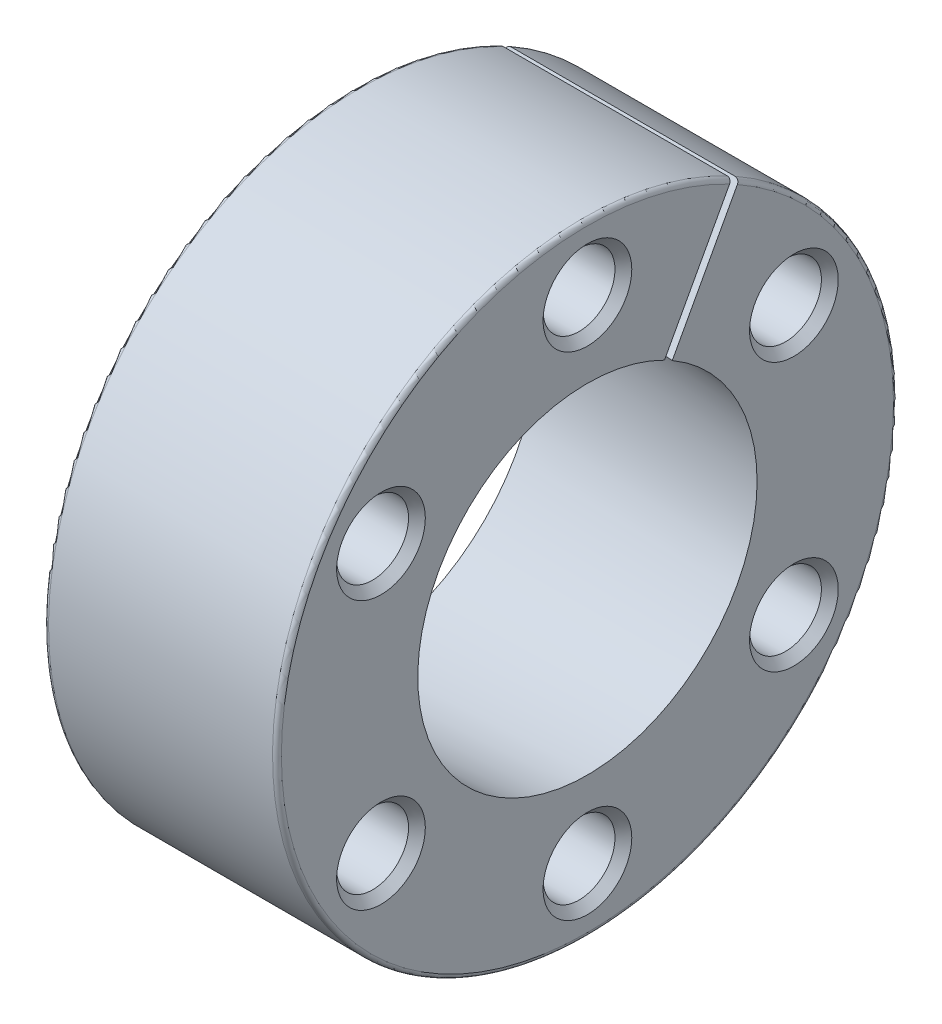
ISO-10303-21;
HEADER;
FILE_DESCRIPTION(('STEP AP214'),'2;1');
FILE_NAME('part.step','',(''),(''),'','','');
FILE_SCHEMA(('AUTOMOTIVE_DESIGN { 1 0 10303 214 1 1 1 1 }'));
ENDSEC;
DATA;
#1=APPLICATION_CONTEXT('core data for automotive mechanical design processes');
#2=APPLICATION_PROTOCOL_DEFINITION('international standard','automotive_design',2000,#1);
#3=PRODUCT_CONTEXT('',#1,'mechanical');
#4=PRODUCT('Part','Part','',(#3));
#5=PRODUCT_RELATED_PRODUCT_CATEGORY('part','',(#4));
#6=PRODUCT_DEFINITION_FORMATION('','',#4);
#7=PRODUCT_DEFINITION_CONTEXT('part definition',#1,'design');
#8=PRODUCT_DEFINITION('design','',#6,#7);
#9=PRODUCT_DEFINITION_SHAPE('','',#8);
#10=(LENGTH_UNIT() NAMED_UNIT(*) SI_UNIT(.MILLI.,.METRE.));
#11=(NAMED_UNIT(*) PLANE_ANGLE_UNIT() SI_UNIT($,.RADIAN.));
#12=(NAMED_UNIT(*) SI_UNIT($,.STERADIAN.) SOLID_ANGLE_UNIT());
#13=UNCERTAINTY_MEASURE_WITH_UNIT(LENGTH_MEASURE(1.E-05),#10,'distance_accuracy_value','');
#14=(GEOMETRIC_REPRESENTATION_CONTEXT(3) GLOBAL_UNCERTAINTY_ASSIGNED_CONTEXT((#13)) GLOBAL_UNIT_ASSIGNED_CONTEXT((#10,
#11,#12)) REPRESENTATION_CONTEXT('',''));
#15=CARTESIAN_POINT('',(0.,0.,0.));
#16=DIRECTION('',(0.,0.,1.));
#17=DIRECTION('',(1.,0.,0.));
#18=AXIS2_PLACEMENT_3D('',#15,#16,#17);
#19=CARTESIAN_POINT('',(12.75,11.1,0.));
#20=DIRECTION('',(1.,0.,0.));
#21=DIRECTION('',(0.,0.,-1.));
#22=AXIS2_PLACEMENT_3D('',#19,#20,#21);
#23=CYLINDRICAL_SURFACE('',#22,1.621);
#24=CARTESIAN_POINT('',(17.6210000000196,11.1,0.));
#25=DIRECTION('',(1.,0.,0.));
#26=DIRECTION('',(0.,1.,0.));
#27=AXIS2_PLACEMENT_3D('',#24,#25,#26);
#28=CIRCLE('',#27,1.62099999999909);
#29=CARTESIAN_POINT('',(17.6210000000196,12.7209999999991,0.));
#30=VERTEX_POINT('',#29);
#31=EDGE_CURVE('E313',#30,#30,#28,.T.);
#32=ORIENTED_EDGE('',*,*,#31,.T.);
#33=EDGE_LOOP('',(#32));
#34=FACE_BOUND('',#33,.T.);
#35=CARTESIAN_POINT('',(7.87900000000263,11.1,0.));
#36=DIRECTION('',(-1.,0.,0.));
#37=DIRECTION('',(0.,1.,0.));
#38=AXIS2_PLACEMENT_3D('',#35,#36,#37);
#39=CIRCLE('',#38,1.62099999999909);
#40=CARTESIAN_POINT('',(7.87900000000263,12.7209999999991,0.));
#41=VERTEX_POINT('',#40);
#42=EDGE_CURVE('E316',#41,#41,#39,.T.);
#43=ORIENTED_EDGE('',*,*,#42,.T.);
#44=EDGE_LOOP('',(#43));
#45=FACE_BOUND('',#44,.T.);
#46=ADVANCED_FACE('F18',(#34,#45),#23,.F.);
#47=CARTESIAN_POINT('',(12.75,6.0454932886668,-9.30924330419421));
#48=DIRECTION('',(1.,0.,0.));
#49=DIRECTION('',(0.,0.,-1.));
#50=AXIS2_PLACEMENT_3D('',#47,#48,#49);
#51=CYLINDRICAL_SURFACE('',#50,1.621);
#52=CARTESIAN_POINT('',(17.6210000000196,6.0454932886668,-9.30924330419421));
#53=DIRECTION('',(1.,0.,0.));
#54=DIRECTION('',(0.,1.,0.));
#55=AXIS2_PLACEMENT_3D('',#52,#53,#54);
#56=CIRCLE('',#55,1.62099999997198);
#57=CARTESIAN_POINT('',(17.6210000000196,7.66649328863877,-9.30924330419421));
#58=VERTEX_POINT('',#57);
#59=EDGE_CURVE('E310',#58,#58,#56,.T.);
#60=ORIENTED_EDGE('',*,*,#59,.T.);
#61=EDGE_LOOP('',(#60));
#62=FACE_BOUND('',#61,.T.);
#63=CARTESIAN_POINT('',(7.87900000000263,6.0454932886668,-9.30924330419421));
#64=DIRECTION('',(-1.,0.,0.));
#65=DIRECTION('',(0.,1.,0.));
#66=AXIS2_PLACEMENT_3D('',#63,#64,#65);
#67=CIRCLE('',#66,1.62099999997198);
#68=CARTESIAN_POINT('',(7.87900000000263,7.66649328863877,-9.30924330419421));
#69=VERTEX_POINT('',#68);
#70=EDGE_CURVE('E319',#69,#69,#67,.T.);
#71=ORIENTED_EDGE('',*,*,#70,.T.);
#72=EDGE_LOOP('',(#71));
#73=FACE_BOUND('',#72,.T.);
#74=ADVANCED_FACE('F557',(#62,#73),#51,.F.);
#75=CARTESIAN_POINT('',(12.75,-6.0454932886668,-9.30924330419421));
#76=DIRECTION('',(1.,0.,0.));
#77=DIRECTION('',(0.,0.,-1.));
#78=AXIS2_PLACEMENT_3D('',#75,#76,#77);
#79=CYLINDRICAL_SURFACE('',#78,1.621);
#80=CARTESIAN_POINT('',(17.6209999999628,-6.0454932886668,-9.30924330419421));
#81=DIRECTION('',(1.,0.,0.));
#82=DIRECTION('',(0.,1.,0.));
#83=AXIS2_PLACEMENT_3D('',#80,#81,#82);
#84=CIRCLE('',#83,1.62099999991453);
#85=CARTESIAN_POINT('',(17.6209999999628,-4.42449328875227,-9.30924330419421));
#86=VERTEX_POINT('',#85);
#87=EDGE_CURVE('E307',#86,#86,#84,.T.);
#88=ORIENTED_EDGE('',*,*,#87,.T.);
#89=EDGE_LOOP('',(#88));
#90=FACE_BOUND('',#89,.T.);
#91=CARTESIAN_POINT('',(7.87900000000263,-6.0454932886668,-9.30924330419421));
#92=DIRECTION('',(-1.,0.,0.));
#93=DIRECTION('',(0.,1.,0.));
#94=AXIS2_PLACEMENT_3D('',#91,#92,#93);
#95=CIRCLE('',#94,1.62100000002821);
#96=CARTESIAN_POINT('',(7.87900000000263,-4.42449328863858,-9.30924330419421));
#97=VERTEX_POINT('',#96);
#98=EDGE_CURVE('E322',#97,#97,#95,.T.);
#99=ORIENTED_EDGE('',*,*,#98,.T.);
#100=EDGE_LOOP('',(#99));
#101=FACE_BOUND('',#100,.T.);
#102=ADVANCED_FACE('F547',(#90,#101),#79,.F.);
#103=CARTESIAN_POINT('',(12.75,-11.1,0.));
#104=DIRECTION('',(1.,0.,0.));
#105=DIRECTION('',(0.,0.,-1.));
#106=AXIS2_PLACEMENT_3D('',#103,#104,#105);
#107=CYLINDRICAL_SURFACE('',#106,1.621);
#108=CARTESIAN_POINT('',(17.6210000000196,-11.1,0.));
#109=DIRECTION('',(1.,0.,0.));
#110=DIRECTION('',(0.,1.,0.));
#111=AXIS2_PLACEMENT_3D('',#108,#109,#110);
#112=CIRCLE('',#111,1.6210000000011);
#113=CARTESIAN_POINT('',(17.6210000000196,-9.4789999999989,0.));
#114=VERTEX_POINT('',#113);
#115=EDGE_CURVE('E304',#114,#114,#112,.T.);
#116=ORIENTED_EDGE('',*,*,#115,.T.);
#117=EDGE_LOOP('',(#116));
#118=FACE_BOUND('',#117,.T.);
#119=CARTESIAN_POINT('',(7.87899999994579,-11.1,0.));
#120=DIRECTION('',(-1.,0.,0.));
#121=DIRECTION('',(0.,1.,0.));
#122=AXIS2_PLACEMENT_3D('',#119,#120,#121);
#123=CIRCLE('',#122,1.6210000000011);
#124=CARTESIAN_POINT('',(7.87899999994579,-9.4789999999989,0.));
#125=VERTEX_POINT('',#124);
#126=EDGE_CURVE('E325',#125,#125,#123,.T.);
#127=ORIENTED_EDGE('',*,*,#126,.T.);
#128=EDGE_LOOP('',(#127));
#129=FACE_BOUND('',#128,.T.);
#130=ADVANCED_FACE('F537',(#118,#129),#107,.F.);
#131=CARTESIAN_POINT('',(12.75,-6.0454932886668,9.30924330419421));
#132=DIRECTION('',(1.,0.,0.));
#133=DIRECTION('',(0.,0.,-1.));
#134=AXIS2_PLACEMENT_3D('',#131,#132,#133);
#135=CYLINDRICAL_SURFACE('',#134,1.621);
#136=CARTESIAN_POINT('',(17.6210000000196,-6.0454932886668,9.30924330419421));
#137=DIRECTION('',(1.,0.,0.));
#138=DIRECTION('',(0.,1.,0.));
#139=AXIS2_PLACEMENT_3D('',#136,#137,#138);
#140=CIRCLE('',#139,1.62100000002822);
#141=CARTESIAN_POINT('',(17.6210000000196,-4.42449328863857,9.30924330419421));
#142=VERTEX_POINT('',#141);
#143=EDGE_CURVE('E301',#142,#142,#140,.T.);
#144=ORIENTED_EDGE('',*,*,#143,.T.);
#145=EDGE_LOOP('',(#144));
#146=FACE_BOUND('',#145,.T.);
#147=CARTESIAN_POINT('',(7.87900000005948,-6.0454932886668,9.30924330419421));
#148=DIRECTION('',(-1.,0.,0.));
#149=DIRECTION('',(0.,1.,0.));
#150=AXIS2_PLACEMENT_3D('',#147,#148,#149);
#151=CIRCLE('',#150,1.62100000002822);
#152=CARTESIAN_POINT('',(7.87900000005948,-4.42449328863857,9.30924330419421));
#153=VERTEX_POINT('',#152);
#154=EDGE_CURVE('E329',#153,#153,#151,.T.);
#155=ORIENTED_EDGE('',*,*,#154,.T.);
#156=EDGE_LOOP('',(#155));
#157=FACE_BOUND('',#156,.T.);
#158=ADVANCED_FACE('F527',(#146,#157),#135,.F.);
#159=CARTESIAN_POINT('',(12.75,6.0454932886668,9.30924330419421));
#160=DIRECTION('',(1.,0.,0.));
#161=DIRECTION('',(0.,0.,-1.));
#162=AXIS2_PLACEMENT_3D('',#159,#160,#161);
#163=CYLINDRICAL_SURFACE('',#162,1.621);
#164=CARTESIAN_POINT('',(17.6209999999628,6.0454932886668,9.30924330419421));
#165=DIRECTION('',(1.,0.,0.));
#166=DIRECTION('',(0.,1.,0.));
#167=AXIS2_PLACEMENT_3D('',#164,#165,#166);
#168=CIRCLE('',#167,1.62099999991513);
#169=CARTESIAN_POINT('',(17.6209999999628,7.66649328858193,9.30924330419421));
#170=VERTEX_POINT('',#169);
#171=EDGE_CURVE('E298',#170,#170,#168,.T.);
#172=ORIENTED_EDGE('',*,*,#171,.T.);
#173=EDGE_LOOP('',(#172));
#174=FACE_BOUND('',#173,.T.);
#175=CARTESIAN_POINT('',(7.87900000000263,6.0454932886668,9.30924330419421));
#176=DIRECTION('',(-1.,0.,0.));
#177=DIRECTION('',(0.,1.,0.));
#178=AXIS2_PLACEMENT_3D('',#175,#176,#177);
#179=CIRCLE('',#178,1.62100000002882);
#180=CARTESIAN_POINT('',(7.87900000000263,7.66649328869562,9.30924330419421));
#181=VERTEX_POINT('',#180);
#182=EDGE_CURVE('E332',#181,#181,#179,.T.);
#183=ORIENTED_EDGE('',*,*,#182,.T.);
#184=EDGE_LOOP('',(#183));
#185=FACE_BOUND('',#184,.T.);
#186=ADVANCED_FACE('F517',(#174,#185),#163,.F.);
#187=CARTESIAN_POINT('',(7.50000000005002,6.0454932886668,9.30924330419421));
#188=DIRECTION('',(-1.,0.,0.));
#189=DIRECTION('',(0.,0.,1.));
#190=AXIS2_PLACEMENT_3D('',#187,#188,#189);
#191=CONICAL_SURFACE('',#190,1.99999999998143,0.785398163397448);
#192=CARTESIAN_POINT('',(7.50000000005002,6.0454932886668,9.30924330419421));
#193=DIRECTION('',(-1.,0.,0.));
#194=DIRECTION('',(0.,0.,1.));
#195=AXIS2_PLACEMENT_3D('',#192,#193,#194);
#196=CIRCLE('',#195,1.99999999998143);
#197=CARTESIAN_POINT('',(7.50000000005002,6.0454932886668,11.3092433041756));
#198=VERTEX_POINT('',#197);
#199=EDGE_CURVE('E612',#198,#198,#196,.F.);
#200=ORIENTED_EDGE('',*,*,#199,.F.);
#201=EDGE_LOOP('',(#200));
#202=FACE_BOUND('',#201,.T.);
#203=ORIENTED_EDGE('',*,*,#182,.F.);
#204=EDGE_LOOP('',(#203));
#205=FACE_BOUND('',#204,.T.);
#206=ADVANCED_FACE('F507',(#202,#205),#191,.F.);
#207=CARTESIAN_POINT('',(7.50000000016371,-6.0454932886668,9.30924330419421));
#208=DIRECTION('',(-1.,0.,0.));
#209=DIRECTION('',(0.,0.,1.));
#210=AXIS2_PLACEMENT_3D('',#207,#208,#209);
#211=CONICAL_SURFACE('',#210,1.99999999992399,0.78539816347244);
#212=CARTESIAN_POINT('',(7.50000000007815,-6.0454932886668,9.30924330419421));
#213=DIRECTION('',(-1.,0.,0.));
#214=DIRECTION('',(0.,0.,1.));
#215=AXIS2_PLACEMENT_3D('',#212,#213,#214);
#216=CIRCLE('',#215,2.00000000000955);
#217=CARTESIAN_POINT('',(7.50000000007815,-6.0454932886668,11.3092433042038));
#218=VERTEX_POINT('',#217);
#219=EDGE_CURVE('E615',#218,#218,#216,.F.);
#220=ORIENTED_EDGE('',*,*,#219,.F.);
#221=EDGE_LOOP('',(#220));
#222=FACE_BOUND('',#221,.T.);
#223=ORIENTED_EDGE('',*,*,#154,.F.);
#224=EDGE_LOOP('',(#223));
#225=FACE_BOUND('',#224,.T.);
#226=ADVANCED_FACE('F497',(#222,#225),#211,.F.);
#227=CARTESIAN_POINT('',(7.49999999993634,-11.1,0.));
#228=DIRECTION('',(-1.,0.,0.));
#229=DIRECTION('',(0.,0.,1.));
#230=AXIS2_PLACEMENT_3D('',#227,#228,#229);
#231=CONICAL_SURFACE('',#230,2.00000000001055,0.785398163397448);
#232=CARTESIAN_POINT('',(7.49999999993634,-11.1,0.));
#233=DIRECTION('',(-1.,0.,0.));
#234=DIRECTION('',(0.,0.,1.));
#235=AXIS2_PLACEMENT_3D('',#232,#233,#234);
#236=CIRCLE('',#235,2.00000000001055);
#237=CARTESIAN_POINT('',(7.49999999993634,-11.1,2.0000000000105));
#238=VERTEX_POINT('',#237);
#239=EDGE_CURVE('E618',#238,#238,#236,.F.);
#240=ORIENTED_EDGE('',*,*,#239,.F.);
#241=EDGE_LOOP('',(#240));
#242=FACE_BOUND('',#241,.T.);
#243=ORIENTED_EDGE('',*,*,#126,.F.);
#244=EDGE_LOOP('',(#243));
#245=FACE_BOUND('',#244,.T.);
#246=ADVANCED_FACE('F487',(#242,#245),#231,.F.);
#247=CARTESIAN_POINT('',(7.50000000005002,-6.0454932886668,-9.30924330419421));
#248=DIRECTION('',(-1.,0.,0.));
#249=DIRECTION('',(0.,0.,1.));
#250=AXIS2_PLACEMENT_3D('',#247,#248,#249);
#251=CONICAL_SURFACE('',#250,2.00000000003767,0.78539816347244);
#252=CARTESIAN_POINT('',(7.50000000002129,-6.0454932886668,-9.30924330419421));
#253=DIRECTION('',(-1.,0.,0.));
#254=DIRECTION('',(0.,0.,1.));
#255=AXIS2_PLACEMENT_3D('',#252,#253,#254);
#256=CIRCLE('',#255,2.00000000006639);
#257=CARTESIAN_POINT('',(7.5000000000213,-6.0454932886668,-7.30924330412781));
#258=VERTEX_POINT('',#257);
#259=EDGE_CURVE('E622',#258,#258,#256,.F.);
#260=ORIENTED_EDGE('',*,*,#259,.F.);
#261=EDGE_LOOP('',(#260));
#262=FACE_BOUND('',#261,.T.);
#263=ORIENTED_EDGE('',*,*,#98,.F.);
#264=EDGE_LOOP('',(#263));
#265=FACE_BOUND('',#264,.T.);
#266=ADVANCED_FACE('F477',(#262,#265),#251,.F.);
#267=CARTESIAN_POINT('',(7.50000000005002,6.0454932886668,-9.30924330419421));
#268=DIRECTION('',(-1.,0.,0.));
#269=DIRECTION('',(0.,0.,1.));
#270=AXIS2_PLACEMENT_3D('',#267,#268,#269);
#271=CONICAL_SURFACE('',#270,1.99999999998143,0.78539816347244);
#272=CARTESIAN_POINT('',(7.50000000007875,6.0454932886668,-9.30924330419421));
#273=DIRECTION('',(-1.,0.,0.));
#274=DIRECTION('',(0.,0.,1.));
#275=AXIS2_PLACEMENT_3D('',#272,#273,#274);
#276=CIRCLE('',#275,1.99999999995271);
#277=CARTESIAN_POINT('',(7.50000000007875,6.0454932886668,-7.3092433042415));
#278=VERTEX_POINT('',#277);
#279=EDGE_CURVE('E625',#278,#278,#276,.F.);
#280=ORIENTED_EDGE('',*,*,#279,.F.);
#281=EDGE_LOOP('',(#280));
#282=FACE_BOUND('',#281,.T.);
#283=ORIENTED_EDGE('',*,*,#70,.F.);
#284=EDGE_LOOP('',(#283));
#285=FACE_BOUND('',#284,.T.);
#286=ADVANCED_FACE('F467',(#282,#285),#271,.F.);
#287=CARTESIAN_POINT('',(7.50000000010687,11.1,0.));
#288=DIRECTION('',(-1.,0.,0.));
#289=DIRECTION('',(0.,0.,1.));
#290=AXIS2_PLACEMENT_3D('',#287,#288,#289);
#291=CONICAL_SURFACE('',#290,1.99999999989486,0.785398163322457);
#292=CARTESIAN_POINT('',(7.50000000005002,11.1,0.));
#293=DIRECTION('',(-1.,0.,0.));
#294=DIRECTION('',(0.,0.,1.));
#295=AXIS2_PLACEMENT_3D('',#292,#293,#294);
#296=CIRCLE('',#295,1.99999999995171);
#297=CARTESIAN_POINT('',(7.50000000005002,11.1,1.99999999995171));
#298=VERTEX_POINT('',#297);
#299=EDGE_CURVE('E105',#298,#298,#296,.F.);
#300=ORIENTED_EDGE('',*,*,#299,.F.);
#301=EDGE_LOOP('',(#300));
#302=FACE_BOUND('',#301,.T.);
#303=ORIENTED_EDGE('',*,*,#42,.F.);
#304=EDGE_LOOP('',(#303));
#305=FACE_BOUND('',#304,.T.);
#306=ADVANCED_FACE('F459',(#302,#305),#291,.F.);
#307=CARTESIAN_POINT('',(7.50000000000001,0.,0.));
#308=DIRECTION('',(-1.,0.,0.));
#309=DIRECTION('',(0.,0.,1.));
#310=AXIS2_PLACEMENT_3D('',#307,#308,#309);
#311=CONICAL_SURFACE('',#310,8.3,0.0618258660986517);
#312=CARTESIAN_POINT('',(7.50000000000001,0.,0.));
#313=DIRECTION('',(-1.,0.,0.));
#314=DIRECTION('',(0.,0.,1.));
#315=AXIS2_PLACEMENT_3D('',#312,#313,#314);
#316=CIRCLE('',#315,8.3);
#317=CARTESIAN_POINT('',(7.50000000000001,7.387495848067,-3.78350434052781));
#318=VERTEX_POINT('',#317);
#319=CARTESIAN_POINT('',(7.50000000000001,7.19663234396317,-4.13503118559259));
#320=VERTEX_POINT('',#319);
#321=EDGE_CURVE('E113',#318,#320,#316,.F.);
#322=ORIENTED_EDGE('',*,*,#321,.F.);
#323=CARTESIAN_POINT('',(7.5,7.387495848067,-3.78350434052781));
#324=CARTESIAN_POINT('',(9.25000017172942,7.29226309555824,-3.73179717476091));
#325=CARTESIAN_POINT('',(11.0000002575941,7.19702912447398,-3.68008934736151));
#326=CARTESIAN_POINT('',(14.5000002575941,7.00655874515444,-3.57667236929767));
#327=CARTESIAN_POINT('',(16.2500001717294,6.91132233691917,-3.52496321863324));
#328=CARTESIAN_POINT('',(18.,6.81608471010839,-3.47325340633629));
#329=B_SPLINE_CURVE_WITH_KNOTS('',3,(#323,#324,#325,#326,#327,#328),.UNSPECIFIED.,.F.,.F.,(4,2,
4),(0.,5.26005623379669,10.5201124675936),.UNSPECIFIED.);
#330=CARTESIAN_POINT('',(18.,6.81608471010839,-3.47325340633629));
#331=VERTEX_POINT('',#330);
#332=EDGE_CURVE('E182',#318,#331,#329,.T.);
#333=ORIENTED_EDGE('',*,*,#332,.T.);
#334=CARTESIAN_POINT('',(18.,0.,0.));
#335=DIRECTION('',(-1.,0.,0.));
#336=DIRECTION('',(0.,0.,1.));
#337=AXIS2_PLACEMENT_3D('',#334,#335,#336);
#338=CIRCLE('',#337,7.65);
#339=CARTESIAN_POINT('',(18.,6.62522120600453,-3.82478025140108));
#340=VERTEX_POINT('',#339);
#341=EDGE_CURVE('E260',#340,#331,#338,.T.);
#342=ORIENTED_EDGE('',*,*,#341,.F.);
#343=CARTESIAN_POINT('',(7.5,7.19663234396317,-4.13503118559259));
#344=CARTESIAN_POINT('',(9.25000017172943,7.10139959145441,-4.0833240198257));
#345=CARTESIAN_POINT('',(11.0000002575941,7.00616562037014,-4.0316161924263));
#346=CARTESIAN_POINT('',(14.5000002575941,6.81569524105059,-3.92819921436246));
#347=CARTESIAN_POINT('',(16.2500001717294,6.72045883281531,-3.87649006369803));
#348=CARTESIAN_POINT('',(18.,6.62522120600453,-3.82478025140108));
#349=B_SPLINE_CURVE_WITH_KNOTS('',3,(#343,#344,#345,#346,#347,#348),.UNSPECIFIED.,.F.,.F.,(4,2,
4),(0.,5.2600562337967,10.5201124675937),.UNSPECIFIED.);
#350=EDGE_CURVE('E104',#320,#340,#349,.T.);
#351=ORIENTED_EDGE('',*,*,#350,.F.);
#352=EDGE_LOOP('',(#322,#333,#342,#351));
#353=FACE_BOUND('',#352,.T.);
#354=ADVANCED_FACE('F346',(#353),#311,.F.);
#355=CARTESIAN_POINT('',(17.9999999999154,11.1,0.));
#356=DIRECTION('',(1.,0.,0.));
#357=DIRECTION('',(0.,0.,-1.));
#358=AXIS2_PLACEMENT_3D('',#355,#356,#357);
#359=CONICAL_SURFACE('',#358,1.99999999989486,0.785398163397448);
#360=CARTESIAN_POINT('',(17.9999999999723,11.1,0.));
#361=DIRECTION('',(1.,0.,0.));
#362=DIRECTION('',(0.,0.,-1.));
#363=AXIS2_PLACEMENT_3D('',#360,#361,#362);
#364=CIRCLE('',#363,1.99999999995171);
#365=CARTESIAN_POINT('',(17.9999999999723,11.1,-1.99999999995171));
#366=VERTEX_POINT('',#365);
#367=EDGE_CURVE('E255',#366,#366,#364,.F.);
#368=ORIENTED_EDGE('',*,*,#367,.F.);
#369=EDGE_LOOP('',(#368));
#370=FACE_BOUND('',#369,.T.);
#371=ORIENTED_EDGE('',*,*,#31,.F.);
#372=EDGE_LOOP('',(#371));
#373=FACE_BOUND('',#372,.T.);
#374=ADVANCED_FACE('F440',(#370,#373),#359,.F.);
#375=CARTESIAN_POINT('',(17.9999999999154,6.0454932886668,-9.30924330419421));
#376=DIRECTION('',(1.,0.,0.));
#377=DIRECTION('',(0.,0.,-1.));
#378=AXIS2_PLACEMENT_3D('',#375,#376,#377);
#379=CONICAL_SURFACE('',#378,1.99999999986774,0.785398163322457);
#380=CARTESIAN_POINT('',(17.9999999999723,6.0454932886668,-9.30924330419421));
#381=DIRECTION('',(1.,0.,0.));
#382=DIRECTION('',(0.,0.,-1.));
#383=AXIS2_PLACEMENT_3D('',#380,#381,#382);
#384=CIRCLE('',#383,1.99999999992459);
#385=CARTESIAN_POINT('',(17.9999999999723,6.0454932886668,-11.3092433041188));
#386=VERTEX_POINT('',#385);
#387=EDGE_CURVE('E258',#386,#386,#384,.F.);
#388=ORIENTED_EDGE('',*,*,#387,.F.);
#389=EDGE_LOOP('',(#388));
#390=FACE_BOUND('',#389,.T.);
#391=ORIENTED_EDGE('',*,*,#59,.F.);
#392=EDGE_LOOP('',(#391));
#393=FACE_BOUND('',#392,.T.);
#394=ADVANCED_FACE('F430',(#390,#393),#379,.F.);
#395=CARTESIAN_POINT('',(17.9999999999154,-6.0454932886668,-9.30924330419421));
#396=DIRECTION('',(1.,0.,0.));
#397=DIRECTION('',(0.,0.,-1.));
#398=AXIS2_PLACEMENT_3D('',#395,#396,#397);
#399=CONICAL_SURFACE('',#398,1.99999999986714,0.785398163397448);
#400=CARTESIAN_POINT('',(17.9999999999723,-6.0454932886668,-9.30924330419421));
#401=DIRECTION('',(1.,0.,0.));
#402=DIRECTION('',(0.,0.,-1.));
#403=AXIS2_PLACEMENT_3D('',#400,#401,#402);
#404=CIRCLE('',#403,1.99999999992398);
#405=CARTESIAN_POINT('',(17.9999999999723,-6.0454932886668,-11.3092433041182));
#406=VERTEX_POINT('',#405);
#407=EDGE_CURVE('E341',#406,#406,#404,.F.);
#408=ORIENTED_EDGE('',*,*,#407,.F.);
#409=EDGE_LOOP('',(#408));
#410=FACE_BOUND('',#409,.T.);
#411=ORIENTED_EDGE('',*,*,#87,.F.);
#412=EDGE_LOOP('',(#411));
#413=FACE_BOUND('',#412,.T.);
#414=ADVANCED_FACE('F420',(#410,#413),#399,.F.);
#415=CARTESIAN_POINT('',(17.9999999999154,-11.1,0.));
#416=DIRECTION('',(1.,0.,0.));
#417=DIRECTION('',(0.,0.,-1.));
#418=AXIS2_PLACEMENT_3D('',#415,#416,#417);
#419=CONICAL_SURFACE('',#418,1.99999999989686,0.785398163397448);
#420=CARTESIAN_POINT('',(17.9999999999723,-11.1,0.));
#421=DIRECTION('',(1.,0.,0.));
#422=DIRECTION('',(0.,0.,-1.));
#423=AXIS2_PLACEMENT_3D('',#420,#421,#422);
#424=CIRCLE('',#423,1.99999999995371);
#425=CARTESIAN_POINT('',(17.9999999999723,-11.1,-1.99999999995376));
#426=VERTEX_POINT('',#425);
#427=EDGE_CURVE('E338',#426,#426,#424,.F.);
#428=ORIENTED_EDGE('',*,*,#427,.F.);
#429=EDGE_LOOP('',(#428));
#430=FACE_BOUND('',#429,.T.);
#431=ORIENTED_EDGE('',*,*,#115,.F.);
#432=EDGE_LOOP('',(#431));
#433=FACE_BOUND('',#432,.T.);
#434=ADVANCED_FACE('F410',(#430,#433),#419,.F.);
#435=CARTESIAN_POINT('',(17.9999999999154,-6.0454932886668,9.30924330419421));
#436=DIRECTION('',(1.,0.,0.));
#437=DIRECTION('',(0.,0.,-1.));
#438=AXIS2_PLACEMENT_3D('',#435,#436,#437);
#439=CONICAL_SURFACE('',#438,1.99999999992399,0.785398163397448);
#440=CARTESIAN_POINT('',(17.9999999999723,-6.0454932886668,9.30924330419421));
#441=DIRECTION('',(1.,0.,0.));
#442=DIRECTION('',(0.,0.,-1.));
#443=AXIS2_PLACEMENT_3D('',#440,#441,#442);
#444=CIRCLE('',#443,1.99999999998083);
#445=CARTESIAN_POINT('',(17.9999999999723,-6.0454932886668,7.30924330421337));
#446=VERTEX_POINT('',#445);
#447=EDGE_CURVE('E294',#446,#446,#444,.F.);
#448=ORIENTED_EDGE('',*,*,#447,.F.);
#449=EDGE_LOOP('',(#448));
#450=FACE_BOUND('',#449,.T.);
#451=ORIENTED_EDGE('',*,*,#143,.F.);
#452=EDGE_LOOP('',(#451));
#453=FACE_BOUND('',#452,.T.);
#454=ADVANCED_FACE('F358',(#450,#453),#439,.F.);
#455=CARTESIAN_POINT('',(17.9999999999154,6.0454932886668,9.30924330419421));
#456=DIRECTION('',(1.,0.,0.));
#457=DIRECTION('',(0.,0.,-1.));
#458=AXIS2_PLACEMENT_3D('',#455,#456,#457);
#459=CONICAL_SURFACE('',#458,1.99999999986774,0.785398163397448);
#460=CARTESIAN_POINT('',(17.9999999999723,6.0454932886668,9.30924330419421));
#461=DIRECTION('',(1.,0.,0.));
#462=DIRECTION('',(0.,0.,-1.));
#463=AXIS2_PLACEMENT_3D('',#460,#461,#462);
#464=CIRCLE('',#463,1.99999999992459);
#465=CARTESIAN_POINT('',(17.9999999999723,6.0454932886668,7.30924330426962));
#466=VERTEX_POINT('',#465);
#467=EDGE_CURVE('E289',#466,#466,#464,.F.);
#468=ORIENTED_EDGE('',*,*,#467,.F.);
#469=EDGE_LOOP('',(#468));
#470=FACE_BOUND('',#469,.T.);
#471=ORIENTED_EDGE('',*,*,#171,.F.);
#472=EDGE_LOOP('',(#471));
#473=FACE_BOUND('',#472,.T.);
#474=ADVANCED_FACE('F351',(#470,#473),#459,.F.);
#475=CARTESIAN_POINT('',(0.,0.0954317520519277,0.175763422532393));
#476=DIRECTION('',(0.,0.477158760259608,0.878817112661965));
#477=DIRECTION('',(0.,-0.878817112661965,0.477158760259608));
#478=AXIS2_PLACEMENT_3D('',#475,#476,#477);
#479=PLANE('',#478);
#480=DIRECTION('',(0.,-0.878817112661964,0.477158760259611));
#481=VECTOR('',#480,1.);
#482=CARTESIAN_POINT('',(7.5,12.2218341919114,-6.40833589829877));
#483=LINE('',#482,#481);
#484=CARTESIAN_POINT('',(7.5,12.2218341919114,-6.40833589829877));
#485=VERTEX_POINT('',#484);
#486=EDGE_CURVE('E174',#485,#318,#483,.T.);
#487=ORIENTED_EDGE('',*,*,#486,.F.);
#488=CARTESIAN_POINT('',(7.7,12.3976158122411,-6.50377753094844));
#489=CARTESIAN_POINT('',(7.68874917511886,12.3976242145592,-6.5037820930348));
#490=CARTESIAN_POINT('',(7.6775012121287,12.3967819177928,-6.50332476320477));
#491=CARTESIAN_POINT('',(7.65533211570594,12.3934579366207,-6.50151998868203));
#492=CARTESIAN_POINT('',(7.6444107319644,12.3909775432569,-6.50017324496794));
#493=CARTESIAN_POINT('',(7.62319211734761,12.3844376328931,-6.49662236336071));
#494=CARTESIAN_POINT('',(7.6128951882932,12.3803773592026,-6.49441781461826));
#495=CARTESIAN_POINT('',(7.59322473021608,12.3707965397116,-6.48921585406837));
#496=CARTESIAN_POINT('',(7.58385103967051,12.3652762499694,-6.48621858128933));
#497=CARTESIAN_POINT('',(7.56628985851758,12.3529302926591,-6.47951527340021));
#498=CARTESIAN_POINT('',(7.55810253491835,12.3461044416167,-6.47580913867173));
#499=CARTESIAN_POINT('',(7.54314801644231,12.3313416637318,-6.46779360427662));
#500=CARTESIAN_POINT('',(7.53638079988854,12.323404753852,-6.46348421381997));
#501=CARTESIAN_POINT('',(7.5244561100066,12.3066428463642,-6.45438324061268));
#502=CARTESIAN_POINT('',(7.51929927789824,12.2978174968439,-6.44959146678922));
#503=CARTESIAN_POINT('',(7.51074725573173,12.2795329990547,-6.43966379449951));
#504=CARTESIAN_POINT('',(7.50735103652067,12.2700742247093,-6.43452809905718));
#505=CARTESIAN_POINT('',(7.50325991241511,12.2541037553437,-6.4258568416892));
#506=CARTESIAN_POINT('',(7.50203818375823,12.247692460276,-6.42237579249011));
#507=CARTESIAN_POINT('',(7.5004083345364,12.2347997358424,-6.41537561427497));
#508=CARTESIAN_POINT('',(7.49999906057253,12.2283184190536,-6.41185654638335));
#509=CARTESIAN_POINT('',(7.5,12.2218341919114,-6.40833589829877));
#510=B_SPLINE_CURVE_WITH_KNOTS('',3,(#488,#489,#490,#491,#492,#493,#494,#495,#496,#497,#498,
#499,#500,#501,#502,#503,#504,#505,#506,#507,#508,#509),.UNSPECIFIED.,.F.,.F.,(4,2,2,2,2,2,2,2,
2,2,4),(0.,0.0337076215862091,0.0673887086539148,0.101085947315618,0.134777280050727,
0.168473351009002,0.202168907582027,0.235877863930217,0.269567093682134,0.291715842831746,
0.313833126023772),.UNSPECIFIED.);
#511=CARTESIAN_POINT('',(7.7,12.3976158122411,-6.50377753094844));
#512=VERTEX_POINT('',#511);
#513=EDGE_CURVE('E78',#512,#485,#510,.T.);
#514=ORIENTED_EDGE('',*,*,#513,.F.);
#515=DIRECTION('',(1.,0.,0.));
#516=VECTOR('',#515,1.);
#517=CARTESIAN_POINT('',(12.75,12.3976158122411,-6.50377753094844));
#518=LINE('',#517,#516);
#519=CARTESIAN_POINT('',(17.8,12.3976158122411,-6.50377753094844));
#520=VERTEX_POINT('',#519);
#521=EDGE_CURVE('E288',#520,#512,#518,.F.);
#522=ORIENTED_EDGE('',*,*,#521,.F.);
#523=CARTESIAN_POINT('',(18.,12.2218341919114,-6.40833589829877));
#524=CARTESIAN_POINT('',(18.0000095523358,12.2317241155663,-6.41370568871612));
#525=CARTESIAN_POINT('',(17.999050931308,12.241611536413,-6.41907412021957));
#526=CARTESIAN_POINT('',(17.9952678204848,12.2610991627268,-6.42965503799913));
#527=CARTESIAN_POINT('',(17.9924447889259,12.2706995865376,-6.43486764282619));
#528=CARTESIAN_POINT('',(17.9850013412777,12.2893518093474,-6.44499497351167));
#529=CARTESIAN_POINT('',(17.9803800601898,12.2984033418917,-6.44990955469701));
#530=CARTESIAN_POINT('',(17.9694752676692,12.3156946087678,-6.45929794660141));
#531=CARTESIAN_POINT('',(17.9631920505122,12.3239344864636,-6.46377183516074));
#532=CARTESIAN_POINT('',(17.9491402308487,12.3393705800824,-6.47215295017121));
#533=CARTESIAN_POINT('',(17.9413715558449,12.3465667450372,-6.47606014894885));
#534=CARTESIAN_POINT('',(17.9245695180168,12.3597105142934,-6.48319663338124));
#535=CARTESIAN_POINT('',(17.9155361766656,12.3656581397897,-6.48642593054394));
#536=CARTESIAN_POINT('',(17.8964604664787,12.3761369541244,-6.49211546251238));
#537=CARTESIAN_POINT('',(17.8864178922837,12.3806678539124,-6.49457554037664));
#538=CARTESIAN_POINT('',(17.8656116452614,12.3881811466449,-6.4986549254888));
#539=CARTESIAN_POINT('',(17.854848400032,12.3911644487968,-6.50027472639612));
#540=CARTESIAN_POINT('',(17.8366826463351,12.3947558129056,-6.50222467800844));
#541=CARTESIAN_POINT('',(17.8293944873756,12.3958276647181,-6.5028066460591));
#542=CARTESIAN_POINT('',(17.8147385714877,12.3972575694836,-6.50358302100136));
#543=CARTESIAN_POINT('',(17.8073709423656,12.3976166344462,-6.50377797736927));
#544=CARTESIAN_POINT('',(17.8,12.3976158122411,-6.50377753094845));
#545=B_SPLINE_CURVE_WITH_KNOTS('',3,(#523,#524,#525,#526,#527,#528,#529,#530,#531,#532,#533,
#534,#535,#536,#537,#538,#539,#540,#541,#542,#543,#544),.UNSPECIFIED.,.F.,.F.,(4,2,2,2,2,2,2,2,
2,2,4),(0.,0.0337161949025525,0.0674060500864344,0.101112130924339,0.134812247486179,
0.168514009192776,0.202215198737615,0.235923259754533,0.26961149492597,0.291737993212021,
0.313833053927528),.UNSPECIFIED.);
#546=CARTESIAN_POINT('',(18.,12.2218341919114,-6.40833589829877));
#547=VERTEX_POINT('',#546);
#548=EDGE_CURVE('E42',#547,#520,#545,.T.);
#549=ORIENTED_EDGE('',*,*,#548,.F.);
#550=DIRECTION('',(0.,0.878817112661965,-0.477158760259609));
#551=VECTOR('',#550,1.);
#552=CARTESIAN_POINT('',(18.,6.81608471010839,-3.47325340633629));
#553=LINE('',#552,#551);
#554=EDGE_CURVE('E256',#331,#547,#553,.T.);
#555=ORIENTED_EDGE('',*,*,#554,.F.);
#556=ORIENTED_EDGE('',*,*,#332,.F.);
#557=EDGE_LOOP('',(#487,#514,#522,#549,#555,#556));
#558=FACE_BOUND('',#557,.T.);
#559=ADVANCED_FACE('F349',(#558),#479,.F.);
#560=CARTESIAN_POINT('',(7.5,11.05,0.));
#561=DIRECTION('',(-1.,0.,0.));
#562=DIRECTION('',(0.,0.,1.));
#563=AXIS2_PLACEMENT_3D('',#560,#561,#562);
#564=PLANE('',#563);
#565=ORIENTED_EDGE('',*,*,#299,.T.);
#566=EDGE_LOOP('',(#565));
#567=FACE_BOUND('',#566,.T.);
#568=ORIENTED_EDGE('',*,*,#279,.T.);
#569=EDGE_LOOP('',(#568));
#570=FACE_BOUND('',#569,.T.);
#571=ORIENTED_EDGE('',*,*,#259,.T.);
#572=EDGE_LOOP('',(#571));
#573=FACE_BOUND('',#572,.T.);
#574=ORIENTED_EDGE('',*,*,#239,.T.);
#575=EDGE_LOOP('',(#574));
#576=FACE_BOUND('',#575,.T.);
#577=ORIENTED_EDGE('',*,*,#219,.T.);
#578=EDGE_LOOP('',(#577));
#579=FACE_BOUND('',#578,.T.);
#580=ORIENTED_EDGE('',*,*,#199,.T.);
#581=EDGE_LOOP('',(#580));
#582=FACE_BOUND('',#581,.T.);
#583=ORIENTED_EDGE('',*,*,#486,.T.);
#584=ORIENTED_EDGE('',*,*,#321,.T.);
#585=DIRECTION('',(0.,-0.878817112661965,0.477158760259608));
#586=VECTOR('',#585,1.);
#587=CARTESIAN_POINT('',(7.5,-0.0954317520519277,-0.175763422532393));
#588=LINE('',#587,#586);
#589=CARTESIAN_POINT('',(7.5,12.0309706878076,-6.75986274336356));
#590=VERTEX_POINT('',#589);
#591=EDGE_CURVE('E110',#590,#320,#588,.T.);
#592=ORIENTED_EDGE('',*,*,#591,.F.);
#593=CARTESIAN_POINT('',(7.5,0.,0.));
#594=DIRECTION('',(1.,0.,0.));
#595=DIRECTION('',(0.,0.,-1.));
#596=AXIS2_PLACEMENT_3D('',#593,#594,#595);
#597=CIRCLE('',#596,13.8);
#598=CARTESIAN_POINT('',(7.5,0.,-13.8));
#599=VERTEX_POINT('',#598);
#600=EDGE_CURVE('E93',#599,#590,#597,.T.);
#601=ORIENTED_EDGE('',*,*,#600,.F.);
#602=CARTESIAN_POINT('',(7.5,0.,0.));
#603=DIRECTION('',(1.,0.,0.));
#604=DIRECTION('',(0.,0.,1.));
#605=AXIS2_PLACEMENT_3D('',#602,#603,#604);
#606=CIRCLE('',#605,13.8);
#607=CARTESIAN_POINT('',(7.5,0.,13.8));
#608=VERTEX_POINT('',#607);
#609=EDGE_CURVE('E100',#608,#599,#606,.T.);
#610=ORIENTED_EDGE('',*,*,#609,.F.);
#611=CARTESIAN_POINT('',(7.5,0.,0.));
#612=DIRECTION('',(1.,0.,0.));
#613=DIRECTION('',(0.,0.885640158834161,-0.46437216654339));
#614=AXIS2_PLACEMENT_3D('',#611,#612,#613);
#615=CIRCLE('',#614,13.8);
#616=EDGE_CURVE('E83',#485,#608,#615,.T.);
#617=ORIENTED_EDGE('',*,*,#616,.F.);
#618=EDGE_LOOP('',(#583,#584,#592,#601,#610,#617));
#619=FACE_BOUND('',#618,.T.);
#620=ADVANCED_FACE('F112',(#567,#570,#573,#576,#579,#582,#619),#564,.T.);
#621=CARTESIAN_POINT('',(0.,-0.0954317520519277,-0.175763422532393));
#622=DIRECTION('',(0.,0.477158760259608,0.878817112661965));
#623=DIRECTION('',(0.,-0.878817112661965,0.477158760259608));
#624=AXIS2_PLACEMENT_3D('',#621,#622,#623);
#625=PLANE('',#624);
#626=CARTESIAN_POINT('',(7.7,12.2067523081373,-6.85530437601323));
#627=CARTESIAN_POINT('',(7.68874917511887,12.2067607104552,-6.85530893809978));
#628=CARTESIAN_POINT('',(7.67750121212871,12.2059184136889,-6.85485160826967));
#629=CARTESIAN_POINT('',(7.65533211570594,12.2025944325169,-6.85304683374671));
#630=CARTESIAN_POINT('',(7.6444107319644,12.2001140391533,-6.85170009003246));
#631=CARTESIAN_POINT('',(7.62319211734761,12.1935741287893,-6.84814920842529));
#632=CARTESIAN_POINT('',(7.6128951882932,12.1895138550988,-6.84594465968305));
#633=CARTESIAN_POINT('',(7.59322473021609,12.1799330356077,-6.84074269913316));
#634=CARTESIAN_POINT('',(7.58385103967051,12.1744127458656,-6.83774542635392));
#635=CARTESIAN_POINT('',(7.56628985851758,12.1620667885553,-6.83104211846479));
#636=CARTESIAN_POINT('',(7.55810253491834,12.1552409375128,-6.8273359837365));
#637=CARTESIAN_POINT('',(7.54314801644231,12.1404781596279,-6.81932044934143));
#638=CARTESIAN_POINT('',(7.53638079988853,12.1325412497482,-6.81501105888463));
#639=CARTESIAN_POINT('',(7.5244561100066,12.1157793422604,-6.80591008567731));
#640=CARTESIAN_POINT('',(7.51929927789824,12.10695399274,-6.80111831185399));
#641=CARTESIAN_POINT('',(7.51074725573173,12.0886694949508,-6.79119063956432));
#642=CARTESIAN_POINT('',(7.50735103652067,12.0792107206055,-6.7860549441219));
#643=CARTESIAN_POINT('',(7.50325991241511,12.0632402512399,-6.77738368675392));
#644=CARTESIAN_POINT('',(7.50203818375824,12.0568289561722,-6.77390263755488));
#645=CARTESIAN_POINT('',(7.5004083345364,12.0439362317385,-6.76690245933979));
#646=CARTESIAN_POINT('',(7.49999906057253,12.0374549149498,-6.76338339144819));
#647=CARTESIAN_POINT('',(7.5,12.0309706878076,-6.75986274336357));
#648=B_SPLINE_CURVE_WITH_KNOTS('',3,(#626,#627,#628,#629,#630,#631,#632,#633,#634,#635,#636,
#637,#638,#639,#640,#641,#642,#643,#644,#645,#646,#647),.UNSPECIFIED.,.F.,.F.,(4,2,2,2,2,2,2,2,
2,2,4),(0.,0.0337076215862104,0.0673887086539099,0.101085947315619,0.134777280050738,
0.168473351009009,0.202168907582033,0.23587786393023,0.269567093682156,0.291715842831748,
0.313833126023754),.UNSPECIFIED.);
#649=CARTESIAN_POINT('',(7.7,12.2067523081372,-6.85530437601324));
#650=VERTEX_POINT('',#649);
#651=EDGE_CURVE('E98',#650,#590,#648,.T.);
#652=ORIENTED_EDGE('',*,*,#651,.T.);
#653=ORIENTED_EDGE('',*,*,#591,.T.);
#654=ORIENTED_EDGE('',*,*,#350,.T.);
#655=DIRECTION('',(0.,-0.878817112661966,0.477158760259608));
#656=VECTOR('',#655,1.);
#657=CARTESIAN_POINT('',(18.,12.0309706878076,-6.75986274336357));
#658=LINE('',#657,#656);
#659=CARTESIAN_POINT('',(18.,12.0309706878076,-6.75986274336356));
#660=VERTEX_POINT('',#659);
#661=EDGE_CURVE('E251',#660,#340,#658,.T.);
#662=ORIENTED_EDGE('',*,*,#661,.F.);
#663=CARTESIAN_POINT('',(17.8,12.2067523081373,-6.85530437601323));
#664=CARTESIAN_POINT('',(17.8112508248811,12.2067607104552,-6.85530893809973));
#665=CARTESIAN_POINT('',(17.8224987878713,12.2059184136889,-6.85485160826964));
#666=CARTESIAN_POINT('',(17.8446678842941,12.2025944325169,-6.85304683374673));
#667=CARTESIAN_POINT('',(17.8555892680356,12.2001140391532,-6.85170009003253));
#668=CARTESIAN_POINT('',(17.8768078826524,12.1935741287893,-6.84814920842534));
#669=CARTESIAN_POINT('',(17.8871048117068,12.1895138550988,-6.84594465968305));
#670=CARTESIAN_POINT('',(17.9067752697839,12.1799330356077,-6.84074269913317));
#671=CARTESIAN_POINT('',(17.9161489603295,12.1744127458656,-6.83774542635397));
#672=CARTESIAN_POINT('',(17.9337101414824,12.1620667885553,-6.83104211846485));
#673=CARTESIAN_POINT('',(17.9418974650817,12.1552409375128,-6.82733598373651));
#674=CARTESIAN_POINT('',(17.9568519835577,12.140478159628,-6.81932044934143));
#675=CARTESIAN_POINT('',(17.9636192001115,12.1325412497482,-6.81501105888465));
#676=CARTESIAN_POINT('',(17.9755438899934,12.1157793422604,-6.80591008567734));
#677=CARTESIAN_POINT('',(17.9807007221018,12.1069539927401,-6.801118311854));
#678=CARTESIAN_POINT('',(17.9892527442683,12.0886694949508,-6.79119063956433));
#679=CARTESIAN_POINT('',(17.9926489634793,12.0792107206055,-6.78605494412193));
#680=CARTESIAN_POINT('',(17.9967400875849,12.0632402512399,-6.77738368675394));
#681=CARTESIAN_POINT('',(17.9979618162418,12.0568289561722,-6.77390263755489));
#682=CARTESIAN_POINT('',(17.9995916654636,12.0439362317385,-6.76690245933979));
#683=CARTESIAN_POINT('',(18.0000009394275,12.0374549149498,-6.76338339144818));
#684=CARTESIAN_POINT('',(18.,12.0309706878076,-6.75986274336357));
#685=B_SPLINE_CURVE_WITH_KNOTS('',3,(#663,#664,#665,#666,#667,#668,#669,#670,#671,#672,#673,
#674,#675,#676,#677,#678,#679,#680,#681,#682,#683,#684),.UNSPECIFIED.,.F.,.F.,(4,2,2,2,2,2,2,2,
2,2,4),(0.,0.033707621586214,0.0673887086539152,0.101085947315616,0.134777280050728,
0.168473351008992,0.202168907582014,0.23587786393021,0.269567093682137,0.291715842831736,
0.313833126023749),.UNSPECIFIED.);
#686=CARTESIAN_POINT('',(17.8,12.2067523081372,-6.85530437601324));
#687=VERTEX_POINT('',#686);
#688=EDGE_CURVE('E117',#687,#660,#685,.T.);
#689=ORIENTED_EDGE('',*,*,#688,.F.);
#690=DIRECTION('',(1.,0.,0.));
#691=VECTOR('',#690,1.);
#692=CARTESIAN_POINT('',(12.75,12.2067523081372,-6.85530437601325));
#693=LINE('',#692,#691);
#694=EDGE_CURVE('E121',#650,#687,#693,.T.);
#695=ORIENTED_EDGE('',*,*,#694,.F.);
#696=EDGE_LOOP('',(#652,#653,#654,#662,#689,#695));
#697=FACE_BOUND('',#696,.T.);
#698=ADVANCED_FACE('F119',(#697),#625,.T.);
#699=CARTESIAN_POINT('',(18.,10.725,0.));
#700=DIRECTION('',(1.,0.,0.));
#701=DIRECTION('',(0.,0.,-1.));
#702=AXIS2_PLACEMENT_3D('',#699,#700,#701);
#703=PLANE('',#702);
#704=ORIENTED_EDGE('',*,*,#467,.T.);
#705=EDGE_LOOP('',(#704));
#706=FACE_BOUND('',#705,.T.);
#707=ORIENTED_EDGE('',*,*,#447,.T.);
#708=EDGE_LOOP('',(#707));
#709=FACE_BOUND('',#708,.T.);
#710=ORIENTED_EDGE('',*,*,#427,.T.);
#711=EDGE_LOOP('',(#710));
#712=FACE_BOUND('',#711,.T.);
#713=ORIENTED_EDGE('',*,*,#407,.T.);
#714=EDGE_LOOP('',(#713));
#715=FACE_BOUND('',#714,.T.);
#716=ORIENTED_EDGE('',*,*,#387,.T.);
#717=EDGE_LOOP('',(#716));
#718=FACE_BOUND('',#717,.T.);
#719=ORIENTED_EDGE('',*,*,#367,.T.);
#720=EDGE_LOOP('',(#719));
#721=FACE_BOUND('',#720,.T.);
#722=CARTESIAN_POINT('',(18.,0.,0.));
#723=DIRECTION('',(-1.,0.,0.));
#724=DIRECTION('',(0.,0.,-1.));
#725=AXIS2_PLACEMENT_3D('',#722,#723,#724);
#726=CIRCLE('',#725,13.8);
#727=CARTESIAN_POINT('',(18.,0.,-13.8));
#728=VERTEX_POINT('',#727);
#729=CARTESIAN_POINT('',(18.,0.,13.8));
#730=VERTEX_POINT('',#729);
#731=EDGE_CURVE('E252',#728,#730,#726,.T.);
#732=ORIENTED_EDGE('',*,*,#731,.F.);
#733=CARTESIAN_POINT('',(18.,0.,0.));
#734=DIRECTION('',(-1.,0.,0.));
#735=DIRECTION('',(0.,0.871809470130985,-0.489845126330692));
#736=AXIS2_PLACEMENT_3D('',#733,#734,#735);
#737=CIRCLE('',#736,13.8);
#738=EDGE_CURVE('E249',#728,#660,#737,.F.);
#739=ORIENTED_EDGE('',*,*,#738,.T.);
#740=ORIENTED_EDGE('',*,*,#661,.T.);
#741=ORIENTED_EDGE('',*,*,#341,.T.);
#742=ORIENTED_EDGE('',*,*,#554,.T.);
#743=CARTESIAN_POINT('',(18.,0.,0.));
#744=DIRECTION('',(-1.,0.,0.));
#745=DIRECTION('',(0.,0.,1.));
#746=AXIS2_PLACEMENT_3D('',#743,#744,#745);
#747=CIRCLE('',#746,13.8);
#748=EDGE_CURVE('E218',#730,#547,#747,.T.);
#749=ORIENTED_EDGE('',*,*,#748,.F.);
#750=EDGE_LOOP('',(#732,#739,#740,#741,#742,#749));
#751=FACE_BOUND('',#750,.T.);
#752=ADVANCED_FACE('F200',(#706,#709,#712,#715,#718,#721,#751),#703,.T.);
#753=CARTESIAN_POINT('',(7.7,0.,0.));
#754=DIRECTION('',(-1.,0.,0.));
#755=DIRECTION('',(0.,0.,1.));
#756=AXIS2_PLACEMENT_3D('',#753,#754,#755);
#757=TOROIDAL_SURFACE('',#756,13.8,0.199999999999999);
#758=ORIENTED_EDGE('',*,*,#651,.F.);
#759=CARTESIAN_POINT('',(7.7,0.,0.));
#760=DIRECTION('',(1.,0.,0.));
#761=DIRECTION('',(0.,0.,-1.));
#762=AXIS2_PLACEMENT_3D('',#759,#760,#761);
#763=CIRCLE('',#762,14.);
#764=EDGE_CURVE('E28',#512,#650,#763,.T.);
#765=ORIENTED_EDGE('',*,*,#764,.F.);
#766=ORIENTED_EDGE('',*,*,#513,.T.);
#767=ORIENTED_EDGE('',*,*,#616,.T.);
#768=ORIENTED_EDGE('',*,*,#609,.T.);
#769=ORIENTED_EDGE('',*,*,#600,.T.);
#770=EDGE_LOOP('',(#758,#765,#766,#767,#768,#769));
#771=FACE_BOUND('',#770,.T.);
#772=ADVANCED_FACE('F96',(#771),#757,.T.);
#773=CARTESIAN_POINT('',(17.8,0.,0.));
#774=DIRECTION('',(-1.,0.,0.));
#775=DIRECTION('',(0.,0.,1.));
#776=AXIS2_PLACEMENT_3D('',#773,#774,#775);
#777=TOROIDAL_SURFACE('',#776,13.8,0.199999999999999);
#778=ORIENTED_EDGE('',*,*,#548,.T.);
#779=CARTESIAN_POINT('',(17.8,0.,0.));
#780=DIRECTION('',(1.,0.,0.));
#781=DIRECTION('',(0.,0.,-1.));
#782=AXIS2_PLACEMENT_3D('',#779,#780,#781);
#783=CIRCLE('',#782,14.);
#784=EDGE_CURVE('E11',#687,#520,#783,.F.);
#785=ORIENTED_EDGE('',*,*,#784,.F.);
#786=ORIENTED_EDGE('',*,*,#688,.T.);
#787=ORIENTED_EDGE('',*,*,#738,.F.);
#788=ORIENTED_EDGE('',*,*,#731,.T.);
#789=ORIENTED_EDGE('',*,*,#748,.T.);
#790=EDGE_LOOP('',(#778,#785,#786,#787,#788,#789));
#791=FACE_BOUND('',#790,.T.);
#792=ADVANCED_FACE('F199',(#791),#777,.T.);
#793=CARTESIAN_POINT('',(12.75,0.,0.));
#794=DIRECTION('',(1.,0.,0.));
#795=DIRECTION('',(0.,0.,-1.));
#796=AXIS2_PLACEMENT_3D('',#793,#794,#795);
#797=CYLINDRICAL_SURFACE('',#796,14.);
#798=ORIENTED_EDGE('',*,*,#784,.T.);
#799=ORIENTED_EDGE('',*,*,#521,.T.);
#800=ORIENTED_EDGE('',*,*,#764,.T.);
#801=ORIENTED_EDGE('',*,*,#694,.T.);
#802=EDGE_LOOP('',(#798,#799,#800,#801));
#803=FACE_BOUND('',#802,.T.);
#804=ADVANCED_FACE('F362',(#803),#797,.T.);
#805=CLOSED_SHELL('',(#46,#74,#102,#130,#158,#186,#206,#226,#246,#266,#286,#306,#354,#374,#394,
#414,#434,#454,#474,#559,#620,#698,#752,#772,#792,#804));
#806=MANIFOLD_SOLID_BREP('B1',#805);
#807=ADVANCED_BREP_SHAPE_REPRESENTATION('',(#18,#806),#14);
#808=SHAPE_DEFINITION_REPRESENTATION(#9,#807);
ENDSEC;
END-ISO-10303-21;
